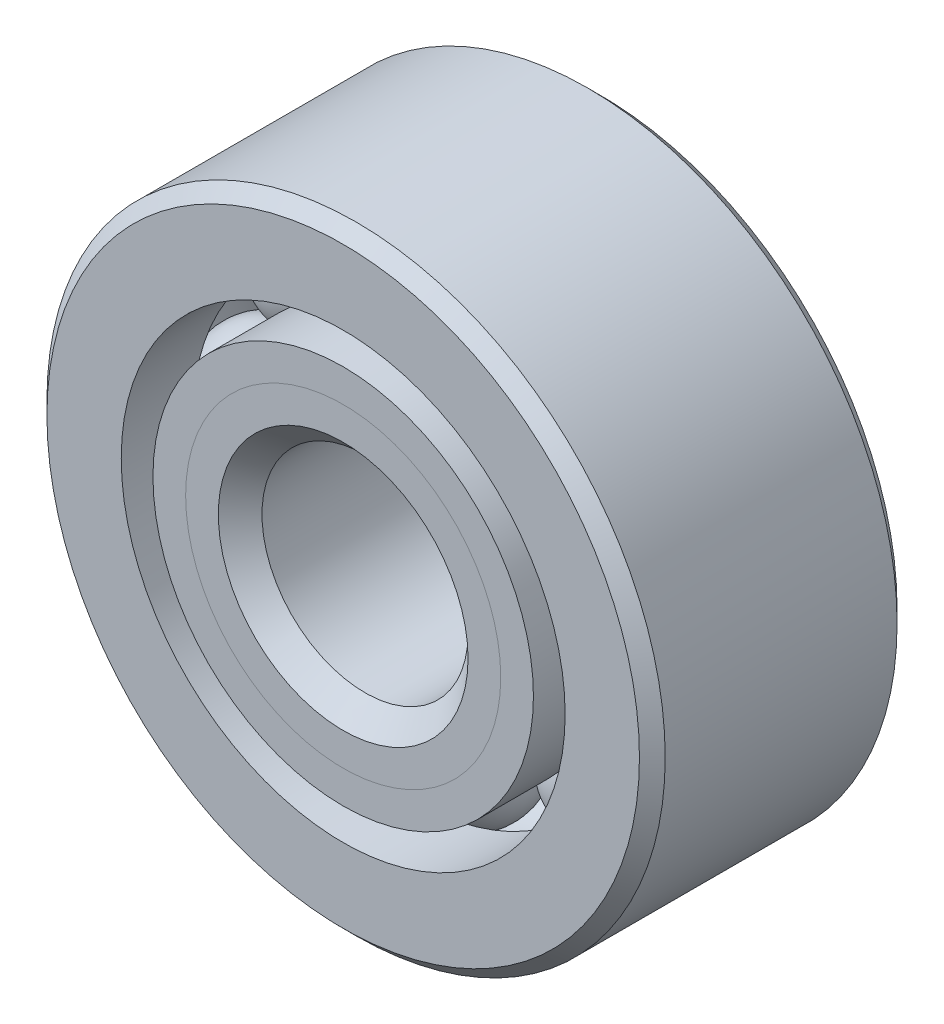
ISO-10303-21;
HEADER;
FILE_DESCRIPTION(('STEP AP214'),'2;1');
FILE_NAME('part.step','',(''),(''),'','','');
FILE_SCHEMA(('AUTOMOTIVE_DESIGN { 1 0 10303 214 1 1 1 1 }'));
ENDSEC;
DATA;
#1=APPLICATION_CONTEXT('core data for automotive mechanical design processes');
#2=APPLICATION_PROTOCOL_DEFINITION('international standard','automotive_design',2000,#1);
#3=PRODUCT_CONTEXT('',#1,'mechanical');
#4=PRODUCT('Part','Part','',(#3));
#5=PRODUCT_RELATED_PRODUCT_CATEGORY('part','',(#4));
#6=PRODUCT_DEFINITION_FORMATION('','',#4);
#7=PRODUCT_DEFINITION_CONTEXT('part definition',#1,'design');
#8=PRODUCT_DEFINITION('design','',#6,#7);
#9=PRODUCT_DEFINITION_SHAPE('','',#8);
#10=(LENGTH_UNIT() NAMED_UNIT(*) SI_UNIT(.MILLI.,.METRE.));
#11=(NAMED_UNIT(*) PLANE_ANGLE_UNIT() SI_UNIT($,.RADIAN.));
#12=(NAMED_UNIT(*) SI_UNIT($,.STERADIAN.) SOLID_ANGLE_UNIT());
#13=UNCERTAINTY_MEASURE_WITH_UNIT(LENGTH_MEASURE(1.E-05),#10,'distance_accuracy_value','');
#14=(GEOMETRIC_REPRESENTATION_CONTEXT(3) GLOBAL_UNCERTAINTY_ASSIGNED_CONTEXT((#13)) GLOBAL_UNIT_ASSIGNED_CONTEXT((#10,
#11,#12)) REPRESENTATION_CONTEXT('',''));
#15=CARTESIAN_POINT('',(0.,0.,0.));
#16=DIRECTION('',(0.,0.,1.));
#17=DIRECTION('',(1.,0.,0.));
#18=AXIS2_PLACEMENT_3D('',#15,#16,#17);
#19=CARTESIAN_POINT('',(-2.24506403026726,2.24506403026732,0.));
#20=DIRECTION('',(0.,0.,1.));
#21=DIRECTION('',(-0.707106781186539,0.707106781186556,0.));
#22=AXIS2_PLACEMENT_3D('',#19,#20,#21);
#23=SPHERICAL_SURFACE('',#22,0.915136422466876);
#24=CARTESIAN_POINT('',(-2.24506403026726,2.24506403026732,0.915136422466876));
#25=VERTEX_POINT('',#24);
#26=VERTEX_LOOP('',#25);
#27=FACE_BOUND('',#26,.T.);
#28=ADVANCED_FACE('F37',(#27),#23,.T.);
#29=CLOSED_SHELL('',(#28));
#30=MANIFOLD_SOLID_BREP('B2',#29);
#31=CARTESIAN_POINT('',(-3.175,0.,0.));
#32=DIRECTION('',(0.,0.,1.));
#33=DIRECTION('',(-1.,0.,0.));
#34=AXIS2_PLACEMENT_3D('',#31,#32,#33);
#35=SPHERICAL_SURFACE('',#34,0.915136422466876);
#36=CARTESIAN_POINT('',(-3.175,0.,0.915136422466876));
#37=VERTEX_POINT('',#36);
#38=VERTEX_LOOP('',#37);
#39=FACE_BOUND('',#38,.T.);
#40=ADVANCED_FACE('F68',(#39),#35,.T.);
#41=CLOSED_SHELL('',(#40));
#42=MANIFOLD_SOLID_BREP('B6',#41);
#43=CARTESIAN_POINT('',(-2.24506403026731,-2.24506403026727,0.));
#44=DIRECTION('',(0.,0.,1.));
#45=DIRECTION('',(-0.707106781186554,-0.707106781186541,0.));
#46=AXIS2_PLACEMENT_3D('',#43,#44,#45);
#47=SPHERICAL_SURFACE('',#46,0.915136422466876);
#48=CARTESIAN_POINT('',(-2.24506403026731,-2.24506403026727,0.915136422466876));
#49=VERTEX_POINT('',#48);
#50=VERTEX_LOOP('',#49);
#51=FACE_BOUND('',#50,.T.);
#52=ADVANCED_FACE('F99',(#51),#47,.T.);
#53=CLOSED_SHELL('',(#52));
#54=MANIFOLD_SOLID_BREP('B33',#53);
#55=CARTESIAN_POINT('',(0.,-3.175,0.));
#56=DIRECTION('',(0.,0.,1.));
#57=DIRECTION('',(0.,-1.,0.));
#58=AXIS2_PLACEMENT_3D('',#55,#56,#57);
#59=SPHERICAL_SURFACE('',#58,0.915136422466876);
#60=CARTESIAN_POINT('',(0.,-3.175,0.915136422466876));
#61=VERTEX_POINT('',#60);
#62=VERTEX_LOOP('',#61);
#63=FACE_BOUND('',#62,.T.);
#64=ADVANCED_FACE('F130',(#63),#59,.T.);
#65=CLOSED_SHELL('',(#64));
#66=MANIFOLD_SOLID_BREP('B64',#65);
#67=CARTESIAN_POINT('',(2.24506403026728,-2.2450640302673,0.));
#68=DIRECTION('',(0.,0.,1.));
#69=DIRECTION('',(0.707106781186544,-0.707106781186551,0.));
#70=AXIS2_PLACEMENT_3D('',#67,#68,#69);
#71=SPHERICAL_SURFACE('',#70,0.915136422466876);
#72=CARTESIAN_POINT('',(2.24506403026728,-2.2450640302673,0.915136422466876));
#73=VERTEX_POINT('',#72);
#74=VERTEX_LOOP('',#73);
#75=FACE_BOUND('',#74,.T.);
#76=ADVANCED_FACE('F161',(#75),#71,.T.);
#77=CLOSED_SHELL('',(#76));
#78=MANIFOLD_SOLID_BREP('B95',#77);
#79=CARTESIAN_POINT('',(3.175,0.,0.));
#80=DIRECTION('',(0.,0.,1.));
#81=DIRECTION('',(1.,0.,0.));
#82=AXIS2_PLACEMENT_3D('',#79,#80,#81);
#83=SPHERICAL_SURFACE('',#82,0.915136422466876);
#84=CARTESIAN_POINT('',(3.175,0.,0.915136422466876));
#85=VERTEX_POINT('',#84);
#86=VERTEX_LOOP('',#85);
#87=FACE_BOUND('',#86,.T.);
#88=ADVANCED_FACE('F192',(#87),#83,.T.);
#89=CLOSED_SHELL('',(#88));
#90=MANIFOLD_SOLID_BREP('B126',#89);
#91=CARTESIAN_POINT('',(2.24506403026729,2.24506403026728,0.));
#92=DIRECTION('',(0.,0.,1.));
#93=DIRECTION('',(0.707106781186549,0.707106781186546,0.));
#94=AXIS2_PLACEMENT_3D('',#91,#92,#93);
#95=SPHERICAL_SURFACE('',#94,0.915136422466876);
#96=CARTESIAN_POINT('',(2.24506403026729,2.24506403026728,0.915136422466876));
#97=VERTEX_POINT('',#96);
#98=VERTEX_LOOP('',#97);
#99=FACE_BOUND('',#98,.T.);
#100=ADVANCED_FACE('F221',(#99),#95,.T.);
#101=CLOSED_SHELL('',(#100));
#102=MANIFOLD_SOLID_BREP('B157',#101);
#103=CARTESIAN_POINT('',(0.,3.175,0.));
#104=DIRECTION('',(0.,0.,1.));
#105=DIRECTION('',(0.,1.,0.));
#106=AXIS2_PLACEMENT_3D('',#103,#104,#105);
#107=SPHERICAL_SURFACE('',#106,0.915136422466876);
#108=CARTESIAN_POINT('',(0.,3.175,0.915136422466876));
#109=VERTEX_POINT('',#108);
#110=VERTEX_LOOP('',#109);
#111=FACE_BOUND('',#110,.T.);
#112=ADVANCED_FACE('F252',(#111),#107,.T.);
#113=CLOSED_SHELL('',(#112));
#114=MANIFOLD_SOLID_BREP('B188',#113);
#115=CARTESIAN_POINT('',(0.,2.4272255097679,1.984375));
#116=DIRECTION('',(0.,0.,-1.));
#117=DIRECTION('',(-1.,0.,0.));
#118=AXIS2_PLACEMENT_3D('',#115,#116,#117);
#119=PLANE('',#118);
#120=CARTESIAN_POINT('',(0.,0.,1.984375));
#121=DIRECTION('',(0.,0.,1.));
#122=DIRECTION('',(1.,0.,0.));
#123=AXIS2_PLACEMENT_3D('',#120,#121,#122);
#124=CIRCLE('',#123,1.92368178876656);
#125=CARTESIAN_POINT('',(1.92368178876656,0.,1.984375));
#126=VERTEX_POINT('',#125);
#127=EDGE_CURVE('E306',#126,#126,#124,.T.);
#128=ORIENTED_EDGE('',*,*,#127,.F.);
#129=EDGE_LOOP('',(#128));
#130=FACE_BOUND('',#129,.T.);
#131=CARTESIAN_POINT('',(0.,0.,1.984375));
#132=DIRECTION('',(0.,0.,1.));
#133=DIRECTION('',(1.,0.,0.));
#134=AXIS2_PLACEMENT_3D('',#131,#132,#133);
#135=CIRCLE('',#134,2.4272255097679);
#136=CARTESIAN_POINT('',(2.4272255097679,0.,1.984375));
#137=VERTEX_POINT('',#136);
#138=EDGE_CURVE('E251',#137,#137,#135,.T.);
#139=ORIENTED_EDGE('',*,*,#138,.T.);
#140=EDGE_LOOP('',(#139));
#141=FACE_BOUND('',#140,.T.);
#142=ADVANCED_FACE('F272',(#130,#141),#119,.F.);
#143=CARTESIAN_POINT('',(0.,0.,1.48083127899867));
#144=DIRECTION('',(0.,0.,1.));
#145=DIRECTION('',(1.,0.,0.));
#146=AXIS2_PLACEMENT_3D('',#143,#144,#145);
#147=CONICAL_SURFACE('',#146,1.92368178876656,0.78539816339745);
#148=ORIENTED_EDGE('',*,*,#138,.F.);
#149=EDGE_LOOP('',(#148));
#150=FACE_BOUND('',#149,.T.);
#151=CARTESIAN_POINT('',(0.,0.,1.48083127899867));
#152=DIRECTION('',(0.,0.,1.));
#153=DIRECTION('',(1.,0.,0.));
#154=AXIS2_PLACEMENT_3D('',#151,#152,#153);
#155=CIRCLE('',#154,1.92368178876656);
#156=CARTESIAN_POINT('',(1.92368178876656,0.,1.48083127899867));
#157=VERTEX_POINT('',#156);
#158=EDGE_CURVE('E278',#157,#157,#155,.T.);
#159=ORIENTED_EDGE('',*,*,#158,.T.);
#160=EDGE_LOOP('',(#159));
#161=FACE_BOUND('',#160,.T.);
#162=ADVANCED_FACE('F313',(#150,#161),#147,.T.);
#163=CARTESIAN_POINT('',(0.,0.,1.984375));
#164=DIRECTION('',(0.,0.,1.));
#165=DIRECTION('',(1.,0.,0.));
#166=AXIS2_PLACEMENT_3D('',#163,#164,#165);
#167=CYLINDRICAL_SURFACE('',#166,1.92368178876656);
#168=ORIENTED_EDGE('',*,*,#158,.F.);
#169=EDGE_LOOP('',(#168));
#170=FACE_BOUND('',#169,.T.);
#171=CARTESIAN_POINT('',(0.,0.,0.));
#172=DIRECTION('',(0.,0.,1.));
#173=DIRECTION('',(1.,0.,0.));
#174=AXIS2_PLACEMENT_3D('',#171,#172,#173);
#175=CIRCLE('',#174,1.92368178876656);
#176=CARTESIAN_POINT('',(1.92368178876656,0.,0.));
#177=VERTEX_POINT('',#176);
#178=EDGE_CURVE('E282',#177,#177,#175,.T.);
#179=ORIENTED_EDGE('',*,*,#178,.T.);
#180=EDGE_LOOP('',(#179));
#181=FACE_BOUND('',#180,.T.);
#182=ADVANCED_FACE('F317',(#170,#181),#167,.T.);
#183=CARTESIAN_POINT('',(0.,1.92368178876656,0.));
#184=DIRECTION('',(0.,0.,-1.));
#185=DIRECTION('',(-1.,0.,0.));
#186=AXIS2_PLACEMENT_3D('',#183,#184,#185);
#187=PLANE('',#186);
#188=ORIENTED_EDGE('',*,*,#178,.F.);
#189=EDGE_LOOP('',(#188));
#190=FACE_BOUND('',#189,.T.);
#191=CARTESIAN_POINT('',(0.,0.,0.));
#192=DIRECTION('',(0.,0.,1.));
#193=DIRECTION('',(1.,0.,0.));
#194=AXIS2_PLACEMENT_3D('',#191,#192,#193);
#195=CIRCLE('',#194,2.25986357753312);
#196=CARTESIAN_POINT('',(2.25986357753312,0.,0.));
#197=VERTEX_POINT('',#196);
#198=EDGE_CURVE('E286',#197,#197,#195,.T.);
#199=ORIENTED_EDGE('',*,*,#198,.T.);
#200=EDGE_LOOP('',(#199));
#201=FACE_BOUND('',#200,.T.);
#202=ADVANCED_FACE('F322',(#190,#201),#187,.F.);
#203=CARTESIAN_POINT('',(0.,0.,0.));
#204=DIRECTION('',(0.,0.,1.));
#205=DIRECTION('',(1.,0.,0.));
#206=AXIS2_PLACEMENT_3D('',#203,#204,#205);
#207=TOROIDAL_SURFACE('',#206,3.175,0.915136422466876);
#208=ORIENTED_EDGE('',*,*,#198,.F.);
#209=EDGE_LOOP('',(#208));
#210=FACE_BOUND('',#209,.T.);
#211=CARTESIAN_POINT('',(0.,0.,-0.881944444444445));
#212=DIRECTION('',(0.,0.,1.));
#213=DIRECTION('',(1.,0.,0.));
#214=AXIS2_PLACEMENT_3D('',#211,#212,#213);
#215=CIRCLE('',#214,2.93076923076923);
#216=CARTESIAN_POINT('',(2.93076923076923,0.,-0.881944444444445));
#217=VERTEX_POINT('',#216);
#218=EDGE_CURVE('E291',#217,#217,#215,.T.);
#219=ORIENTED_EDGE('',*,*,#218,.T.);
#220=EDGE_LOOP('',(#219));
#221=FACE_BOUND('',#220,.T.);
#222=ADVANCED_FACE('F328',(#210,#221),#207,.F.);
#223=CARTESIAN_POINT('',(0.,0.,1.984375));
#224=DIRECTION('',(0.,0.,1.));
#225=DIRECTION('',(1.,0.,0.));
#226=AXIS2_PLACEMENT_3D('',#223,#224,#225);
#227=CYLINDRICAL_SURFACE('',#226,2.93076923076923);
#228=ORIENTED_EDGE('',*,*,#218,.F.);
#229=EDGE_LOOP('',(#228));
#230=FACE_BOUND('',#229,.T.);
#231=CARTESIAN_POINT('',(0.,0.,-1.984375));
#232=DIRECTION('',(0.,0.,1.));
#233=DIRECTION('',(1.,0.,0.));
#234=AXIS2_PLACEMENT_3D('',#231,#232,#233);
#235=CIRCLE('',#234,2.93076923076923);
#236=CARTESIAN_POINT('',(2.93076923076923,0.,-1.984375));
#237=VERTEX_POINT('',#236);
#238=EDGE_CURVE('E294',#237,#237,#235,.T.);
#239=ORIENTED_EDGE('',*,*,#238,.T.);
#240=EDGE_LOOP('',(#239));
#241=FACE_BOUND('',#240,.T.);
#242=ADVANCED_FACE('F332',(#230,#241),#227,.T.);
#243=CARTESIAN_POINT('',(0.,1.7859375,-1.984375));
#244=DIRECTION('',(0.,0.,1.));
#245=DIRECTION('',(1.,0.,0.));
#246=AXIS2_PLACEMENT_3D('',#243,#244,#245);
#247=PLANE('',#246);
#248=ORIENTED_EDGE('',*,*,#238,.F.);
#249=EDGE_LOOP('',(#248));
#250=FACE_BOUND('',#249,.T.);
#251=CARTESIAN_POINT('',(0.,0.,-1.984375));
#252=DIRECTION('',(0.,0.,1.));
#253=DIRECTION('',(1.,0.,0.));
#254=AXIS2_PLACEMENT_3D('',#251,#252,#253);
#255=CIRCLE('',#254,1.7859375);
#256=CARTESIAN_POINT('',(1.7859375,0.,-1.984375));
#257=VERTEX_POINT('',#256);
#258=EDGE_CURVE('E297',#257,#257,#255,.T.);
#259=ORIENTED_EDGE('',*,*,#258,.T.);
#260=EDGE_LOOP('',(#259));
#261=FACE_BOUND('',#260,.T.);
#262=ADVANCED_FACE('F336',(#250,#261),#247,.F.);
#263=CARTESIAN_POINT('',(0.,0.,-1.7859375));
#264=DIRECTION('',(0.,0.,-1.));
#265=DIRECTION('',(-1.,0.,0.));
#266=AXIS2_PLACEMENT_3D('',#263,#264,#265);
#267=CONICAL_SURFACE('',#266,1.5875,0.785398163397446);
#268=ORIENTED_EDGE('',*,*,#258,.F.);
#269=EDGE_LOOP('',(#268));
#270=FACE_BOUND('',#269,.T.);
#271=CARTESIAN_POINT('',(0.,0.,-1.7859375));
#272=DIRECTION('',(0.,0.,1.));
#273=DIRECTION('',(1.,0.,0.));
#274=AXIS2_PLACEMENT_3D('',#271,#272,#273);
#275=CIRCLE('',#274,1.5875);
#276=CARTESIAN_POINT('',(1.5875,0.,-1.7859375));
#277=VERTEX_POINT('',#276);
#278=EDGE_CURVE('E300',#277,#277,#275,.T.);
#279=ORIENTED_EDGE('',*,*,#278,.T.);
#280=EDGE_LOOP('',(#279));
#281=FACE_BOUND('',#280,.T.);
#282=ADVANCED_FACE('F340',(#270,#281),#267,.F.);
#283=CARTESIAN_POINT('',(0.,0.,1.984375));
#284=DIRECTION('',(0.,0.,1.));
#285=DIRECTION('',(1.,0.,0.));
#286=AXIS2_PLACEMENT_3D('',#283,#284,#285);
#287=CYLINDRICAL_SURFACE('',#286,1.5875);
#288=ORIENTED_EDGE('',*,*,#278,.F.);
#289=EDGE_LOOP('',(#288));
#290=FACE_BOUND('',#289,.T.);
#291=CARTESIAN_POINT('',(0.,0.,1.64819321123344));
#292=DIRECTION('',(0.,0.,1.));
#293=DIRECTION('',(1.,0.,0.));
#294=AXIS2_PLACEMENT_3D('',#291,#292,#293);
#295=CIRCLE('',#294,1.5875);
#296=CARTESIAN_POINT('',(1.5875,0.,1.64819321123344));
#297=VERTEX_POINT('',#296);
#298=EDGE_CURVE('E303',#297,#297,#295,.T.);
#299=ORIENTED_EDGE('',*,*,#298,.T.);
#300=EDGE_LOOP('',(#299));
#301=FACE_BOUND('',#300,.T.);
#302=ADVANCED_FACE('F344',(#290,#301),#287,.F.);
#303=CARTESIAN_POINT('',(0.,0.,1.984375));
#304=DIRECTION('',(0.,0.,1.));
#305=DIRECTION('',(1.,0.,0.));
#306=AXIS2_PLACEMENT_3D('',#303,#304,#305);
#307=CONICAL_SURFACE('',#306,1.92368178876656,0.78539816339745);
#308=ORIENTED_EDGE('',*,*,#298,.F.);
#309=EDGE_LOOP('',(#308));
#310=FACE_BOUND('',#309,.T.);
#311=ORIENTED_EDGE('',*,*,#127,.T.);
#312=EDGE_LOOP('',(#311));
#313=FACE_BOUND('',#312,.T.);
#314=ADVANCED_FACE('F310',(#310,#313),#307,.F.);
#315=CLOSED_SHELL('',(#142,#162,#182,#202,#222,#242,#262,#282,#302,#314));
#316=MANIFOLD_SOLID_BREP('B217',#315);
#317=CARTESIAN_POINT('',(0.,2.93076923076923,1.984375));
#318=DIRECTION('',(0.,0.,-1.));
#319=DIRECTION('',(-1.,0.,0.));
#320=AXIS2_PLACEMENT_3D('',#317,#318,#319);
#321=PLANE('',#320);
#322=CARTESIAN_POINT('',(0.,0.,1.984375));
#323=DIRECTION('',(0.,0.,1.));
#324=DIRECTION('',(1.,0.,0.));
#325=AXIS2_PLACEMENT_3D('',#322,#323,#324);
#326=CIRCLE('',#325,2.4272255097679);
#327=CARTESIAN_POINT('',(2.4272255097679,0.,1.984375));
#328=VERTEX_POINT('',#327);
#329=EDGE_CURVE('E271',#328,#328,#326,.T.);
#330=ORIENTED_EDGE('',*,*,#329,.F.);
#331=EDGE_LOOP('',(#330));
#332=FACE_BOUND('',#331,.T.);
#333=CARTESIAN_POINT('',(0.,0.,1.984375));
#334=DIRECTION('',(0.,0.,1.));
#335=DIRECTION('',(1.,0.,0.));
#336=AXIS2_PLACEMENT_3D('',#333,#334,#335);
#337=CIRCLE('',#336,2.93076923076923);
#338=CARTESIAN_POINT('',(2.93076923076923,0.,1.984375));
#339=VERTEX_POINT('',#338);
#340=EDGE_CURVE('E452',#339,#339,#337,.T.);
#341=ORIENTED_EDGE('',*,*,#340,.T.);
#342=EDGE_LOOP('',(#341));
#343=FACE_BOUND('',#342,.T.);
#344=ADVANCED_FACE('F430',(#332,#343),#321,.F.);
#345=CARTESIAN_POINT('',(0.,0.,1.984375));
#346=DIRECTION('',(0.,0.,1.));
#347=DIRECTION('',(1.,0.,0.));
#348=AXIS2_PLACEMENT_3D('',#345,#346,#347);
#349=CONICAL_SURFACE('',#348,2.4272255097679,0.78539816339745);
#350=CARTESIAN_POINT('',(0.,0.,1.48083127899867));
#351=DIRECTION('',(0.,0.,1.));
#352=DIRECTION('',(1.,0.,0.));
#353=AXIS2_PLACEMENT_3D('',#350,#351,#352);
#354=CIRCLE('',#353,1.92368178876656);
#355=CARTESIAN_POINT('',(1.92368178876656,0.,1.48083127899867));
#356=VERTEX_POINT('',#355);
#357=EDGE_CURVE('E436',#356,#356,#354,.T.);
#358=ORIENTED_EDGE('',*,*,#357,.F.);
#359=EDGE_LOOP('',(#358));
#360=FACE_BOUND('',#359,.T.);
#361=ORIENTED_EDGE('',*,*,#329,.T.);
#362=EDGE_LOOP('',(#361));
#363=FACE_BOUND('',#362,.T.);
#364=ADVANCED_FACE('F477',(#360,#363),#349,.F.);
#365=CARTESIAN_POINT('',(0.,0.,1.984375));
#366=DIRECTION('',(0.,0.,1.));
#367=DIRECTION('',(1.,0.,0.));
#368=AXIS2_PLACEMENT_3D('',#365,#366,#367);
#369=CYLINDRICAL_SURFACE('',#368,1.92368178876656);
#370=CARTESIAN_POINT('',(0.,0.,0.));
#371=DIRECTION('',(0.,0.,1.));
#372=DIRECTION('',(1.,0.,0.));
#373=AXIS2_PLACEMENT_3D('',#370,#371,#372);
#374=CIRCLE('',#373,1.92368178876656);
#375=CARTESIAN_POINT('',(1.92368178876656,0.,0.));
#376=VERTEX_POINT('',#375);
#377=EDGE_CURVE('E440',#376,#376,#374,.T.);
#378=ORIENTED_EDGE('',*,*,#377,.F.);
#379=EDGE_LOOP('',(#378));
#380=FACE_BOUND('',#379,.T.);
#381=ORIENTED_EDGE('',*,*,#357,.T.);
#382=EDGE_LOOP('',(#381));
#383=FACE_BOUND('',#382,.T.);
#384=ADVANCED_FACE('F472',(#380,#383),#369,.F.);
#385=CARTESIAN_POINT('',(0.,1.92368178876656,0.));
#386=DIRECTION('',(0.,0.,1.));
#387=DIRECTION('',(1.,0.,0.));
#388=AXIS2_PLACEMENT_3D('',#385,#386,#387);
#389=PLANE('',#388);
#390=CARTESIAN_POINT('',(0.,0.,0.));
#391=DIRECTION('',(0.,0.,1.));
#392=DIRECTION('',(1.,0.,0.));
#393=AXIS2_PLACEMENT_3D('',#390,#391,#392);
#394=CIRCLE('',#393,2.25986357753312);
#395=CARTESIAN_POINT('',(2.25986357753312,0.,0.));
#396=VERTEX_POINT('',#395);
#397=EDGE_CURVE('E444',#396,#396,#394,.T.);
#398=ORIENTED_EDGE('',*,*,#397,.F.);
#399=EDGE_LOOP('',(#398));
#400=FACE_BOUND('',#399,.T.);
#401=ORIENTED_EDGE('',*,*,#377,.T.);
#402=EDGE_LOOP('',(#401));
#403=FACE_BOUND('',#402,.T.);
#404=ADVANCED_FACE('F466',(#400,#403),#389,.F.);
#405=CARTESIAN_POINT('',(0.,0.,0.));
#406=DIRECTION('',(0.,0.,1.));
#407=DIRECTION('',(1.,0.,0.));
#408=AXIS2_PLACEMENT_3D('',#405,#406,#407);
#409=TOROIDAL_SURFACE('',#408,3.175,0.915136422466876);
#410=CARTESIAN_POINT('',(0.,0.,0.881944444444444));
#411=DIRECTION('',(0.,0.,1.));
#412=DIRECTION('',(1.,0.,0.));
#413=AXIS2_PLACEMENT_3D('',#410,#411,#412);
#414=CIRCLE('',#413,2.93076923076923);
#415=CARTESIAN_POINT('',(2.93076923076923,0.,0.881944444444444));
#416=VERTEX_POINT('',#415);
#417=EDGE_CURVE('E449',#416,#416,#414,.T.);
#418=ORIENTED_EDGE('',*,*,#417,.F.);
#419=EDGE_LOOP('',(#418));
#420=FACE_BOUND('',#419,.T.);
#421=ORIENTED_EDGE('',*,*,#397,.T.);
#422=EDGE_LOOP('',(#421));
#423=FACE_BOUND('',#422,.T.);
#424=ADVANCED_FACE('F460',(#420,#423),#409,.F.);
#425=CARTESIAN_POINT('',(0.,0.,1.984375));
#426=DIRECTION('',(0.,0.,1.));
#427=DIRECTION('',(1.,0.,0.));
#428=AXIS2_PLACEMENT_3D('',#425,#426,#427);
#429=CYLINDRICAL_SURFACE('',#428,2.93076923076923);
#430=ORIENTED_EDGE('',*,*,#340,.F.);
#431=EDGE_LOOP('',(#430));
#432=FACE_BOUND('',#431,.T.);
#433=ORIENTED_EDGE('',*,*,#417,.T.);
#434=EDGE_LOOP('',(#433));
#435=FACE_BOUND('',#434,.T.);
#436=ADVANCED_FACE('F457',(#432,#435),#429,.T.);
#437=CLOSED_SHELL('',(#344,#364,#384,#404,#424,#436));
#438=MANIFOLD_SOLID_BREP('B246',#437);
#439=CARTESIAN_POINT('',(0.,0.,1.7859375));
#440=DIRECTION('',(0.,0.,-1.));
#441=DIRECTION('',(-1.,0.,0.));
#442=AXIS2_PLACEMENT_3D('',#439,#440,#441);
#443=CONICAL_SURFACE('',#442,4.7625,0.785398163397448);
#444=CARTESIAN_POINT('',(0.,0.,1.984375));
#445=DIRECTION('',(0.,0.,1.));
#446=DIRECTION('',(1.,0.,0.));
#447=AXIS2_PLACEMENT_3D('',#444,#445,#446);
#448=CIRCLE('',#447,4.5640625);
#449=CARTESIAN_POINT('',(4.5640625,0.,1.984375));
#450=VERTEX_POINT('',#449);
#451=EDGE_CURVE('E549',#450,#450,#448,.T.);
#452=ORIENTED_EDGE('',*,*,#451,.F.);
#453=EDGE_LOOP('',(#452));
#454=FACE_BOUND('',#453,.T.);
#455=CARTESIAN_POINT('',(0.,0.,1.7859375));
#456=DIRECTION('',(0.,0.,1.));
#457=DIRECTION('',(1.,0.,0.));
#458=AXIS2_PLACEMENT_3D('',#455,#456,#457);
#459=CIRCLE('',#458,4.7625);
#460=CARTESIAN_POINT('',(4.7625,0.,1.7859375));
#461=VERTEX_POINT('',#460);
#462=EDGE_CURVE('E429',#461,#461,#459,.T.);
#463=ORIENTED_EDGE('',*,*,#462,.T.);
#464=EDGE_LOOP('',(#463));
#465=FACE_BOUND('',#464,.T.);
#466=ADVANCED_FACE('F521',(#454,#465),#443,.T.);
#467=CARTESIAN_POINT('',(0.,0.,1.984375));
#468=DIRECTION('',(0.,0.,1.));
#469=DIRECTION('',(1.,0.,0.));
#470=AXIS2_PLACEMENT_3D('',#467,#468,#469);
#471=CYLINDRICAL_SURFACE('',#470,4.7625);
#472=ORIENTED_EDGE('',*,*,#462,.F.);
#473=EDGE_LOOP('',(#472));
#474=FACE_BOUND('',#473,.T.);
#475=CARTESIAN_POINT('',(0.,0.,-1.7859375));
#476=DIRECTION('',(0.,0.,1.));
#477=DIRECTION('',(1.,0.,0.));
#478=AXIS2_PLACEMENT_3D('',#475,#476,#477);
#479=CIRCLE('',#478,4.7625);
#480=CARTESIAN_POINT('',(4.7625,0.,-1.7859375));
#481=VERTEX_POINT('',#480);
#482=EDGE_CURVE('E527',#481,#481,#479,.T.);
#483=ORIENTED_EDGE('',*,*,#482,.T.);
#484=EDGE_LOOP('',(#483));
#485=FACE_BOUND('',#484,.T.);
#486=ADVANCED_FACE('F556',(#474,#485),#471,.T.);
#487=CARTESIAN_POINT('',(0.,0.,-1.984375));
#488=DIRECTION('',(0.,0.,1.));
#489=DIRECTION('',(1.,0.,0.));
#490=AXIS2_PLACEMENT_3D('',#487,#488,#489);
#491=CONICAL_SURFACE('',#490,4.5640625,0.785398163397446);
#492=ORIENTED_EDGE('',*,*,#482,.F.);
#493=EDGE_LOOP('',(#492));
#494=FACE_BOUND('',#493,.T.);
#495=CARTESIAN_POINT('',(0.,0.,-1.984375));
#496=DIRECTION('',(0.,0.,1.));
#497=DIRECTION('',(1.,0.,0.));
#498=AXIS2_PLACEMENT_3D('',#495,#496,#497);
#499=CIRCLE('',#498,4.5640625);
#500=CARTESIAN_POINT('',(4.5640625,0.,-1.984375));
#501=VERTEX_POINT('',#500);
#502=EDGE_CURVE('E531',#501,#501,#499,.T.);
#503=ORIENTED_EDGE('',*,*,#502,.T.);
#504=EDGE_LOOP('',(#503));
#505=FACE_BOUND('',#504,.T.);
#506=ADVANCED_FACE('F560',(#494,#505),#491,.T.);
#507=CARTESIAN_POINT('',(0.,4.5640625,-1.984375));
#508=DIRECTION('',(0.,0.,1.));
#509=DIRECTION('',(1.,0.,0.));
#510=AXIS2_PLACEMENT_3D('',#507,#508,#509);
#511=PLANE('',#510);
#512=ORIENTED_EDGE('',*,*,#502,.F.);
#513=EDGE_LOOP('',(#512));
#514=FACE_BOUND('',#513,.T.);
#515=CARTESIAN_POINT('',(0.,0.,-1.984375));
#516=DIRECTION('',(0.,0.,1.));
#517=DIRECTION('',(1.,0.,0.));
#518=AXIS2_PLACEMENT_3D('',#515,#516,#517);
#519=CIRCLE('',#518,3.41923076923077);
#520=CARTESIAN_POINT('',(3.41923076923077,0.,-1.984375));
#521=VERTEX_POINT('',#520);
#522=EDGE_CURVE('E535',#521,#521,#519,.T.);
#523=ORIENTED_EDGE('',*,*,#522,.T.);
#524=EDGE_LOOP('',(#523));
#525=FACE_BOUND('',#524,.T.);
#526=ADVANCED_FACE('F565',(#514,#525),#511,.F.);
#527=CARTESIAN_POINT('',(0.,0.,1.984375));
#528=DIRECTION('',(0.,0.,1.));
#529=DIRECTION('',(1.,0.,0.));
#530=AXIS2_PLACEMENT_3D('',#527,#528,#529);
#531=CYLINDRICAL_SURFACE('',#530,3.41923076923077);
#532=ORIENTED_EDGE('',*,*,#522,.F.);
#533=EDGE_LOOP('',(#532));
#534=FACE_BOUND('',#533,.T.);
#535=CARTESIAN_POINT('',(0.,0.,-0.881944444444445));
#536=DIRECTION('',(0.,0.,1.));
#537=DIRECTION('',(1.,0.,0.));
#538=AXIS2_PLACEMENT_3D('',#535,#536,#537);
#539=CIRCLE('',#538,3.41923076923077);
#540=CARTESIAN_POINT('',(3.41923076923077,0.,-0.881944444444445));
#541=VERTEX_POINT('',#540);
#542=EDGE_CURVE('E540',#541,#541,#539,.T.);
#543=ORIENTED_EDGE('',*,*,#542,.T.);
#544=EDGE_LOOP('',(#543));
#545=FACE_BOUND('',#544,.T.);
#546=ADVANCED_FACE('F571',(#534,#545),#531,.F.);
#547=CARTESIAN_POINT('',(0.,0.,0.));
#548=DIRECTION('',(0.,0.,1.));
#549=DIRECTION('',(1.,0.,0.));
#550=AXIS2_PLACEMENT_3D('',#547,#548,#549);
#551=TOROIDAL_SURFACE('',#550,3.175,0.915136422466876);
#552=ORIENTED_EDGE('',*,*,#542,.F.);
#553=EDGE_LOOP('',(#552));
#554=FACE_BOUND('',#553,.T.);
#555=CARTESIAN_POINT('',(0.,0.,0.881944444444444));
#556=DIRECTION('',(0.,0.,1.));
#557=DIRECTION('',(1.,0.,0.));
#558=AXIS2_PLACEMENT_3D('',#555,#556,#557);
#559=CIRCLE('',#558,3.41923076923077);
#560=CARTESIAN_POINT('',(3.41923076923077,0.,0.881944444444444));
#561=VERTEX_POINT('',#560);
#562=EDGE_CURVE('E543',#561,#561,#559,.T.);
#563=ORIENTED_EDGE('',*,*,#562,.T.);
#564=EDGE_LOOP('',(#563));
#565=FACE_BOUND('',#564,.T.);
#566=ADVANCED_FACE('F575',(#554,#565),#551,.F.);
#567=CARTESIAN_POINT('',(0.,0.,1.984375));
#568=DIRECTION('',(0.,0.,1.));
#569=DIRECTION('',(1.,0.,0.));
#570=AXIS2_PLACEMENT_3D('',#567,#568,#569);
#571=CYLINDRICAL_SURFACE('',#570,3.41923076923077);
#572=ORIENTED_EDGE('',*,*,#562,.F.);
#573=EDGE_LOOP('',(#572));
#574=FACE_BOUND('',#573,.T.);
#575=CARTESIAN_POINT('',(0.,0.,1.984375));
#576=DIRECTION('',(0.,0.,1.));
#577=DIRECTION('',(1.,0.,0.));
#578=AXIS2_PLACEMENT_3D('',#575,#576,#577);
#579=CIRCLE('',#578,3.41923076923077);
#580=CARTESIAN_POINT('',(3.41923076923077,0.,1.984375));
#581=VERTEX_POINT('',#580);
#582=EDGE_CURVE('E546',#581,#581,#579,.T.);
#583=ORIENTED_EDGE('',*,*,#582,.T.);
#584=EDGE_LOOP('',(#583));
#585=FACE_BOUND('',#584,.T.);
#586=ADVANCED_FACE('F579',(#574,#585),#571,.F.);
#587=CARTESIAN_POINT('',(0.,4.5640625,1.984375));
#588=DIRECTION('',(0.,0.,-1.));
#589=DIRECTION('',(-1.,0.,0.));
#590=AXIS2_PLACEMENT_3D('',#587,#588,#589);
#591=PLANE('',#590);
#592=ORIENTED_EDGE('',*,*,#582,.F.);
#593=EDGE_LOOP('',(#592));
#594=FACE_BOUND('',#593,.T.);
#595=ORIENTED_EDGE('',*,*,#451,.T.);
#596=EDGE_LOOP('',(#595));
#597=FACE_BOUND('',#596,.T.);
#598=ADVANCED_FACE('F553',(#594,#597),#591,.F.);
#599=CLOSED_SHELL('',(#466,#486,#506,#526,#546,#566,#586,#598));
#600=MANIFOLD_SOLID_BREP('B266',#599);
#601=ADVANCED_BREP_SHAPE_REPRESENTATION('',(#18,#30,#42,#54,#66,#78,#90,#102,#114,#316,#438,
#600),#14);
#602=SHAPE_DEFINITION_REPRESENTATION(#9,#601);
ENDSEC;
END-ISO-10303-21;
